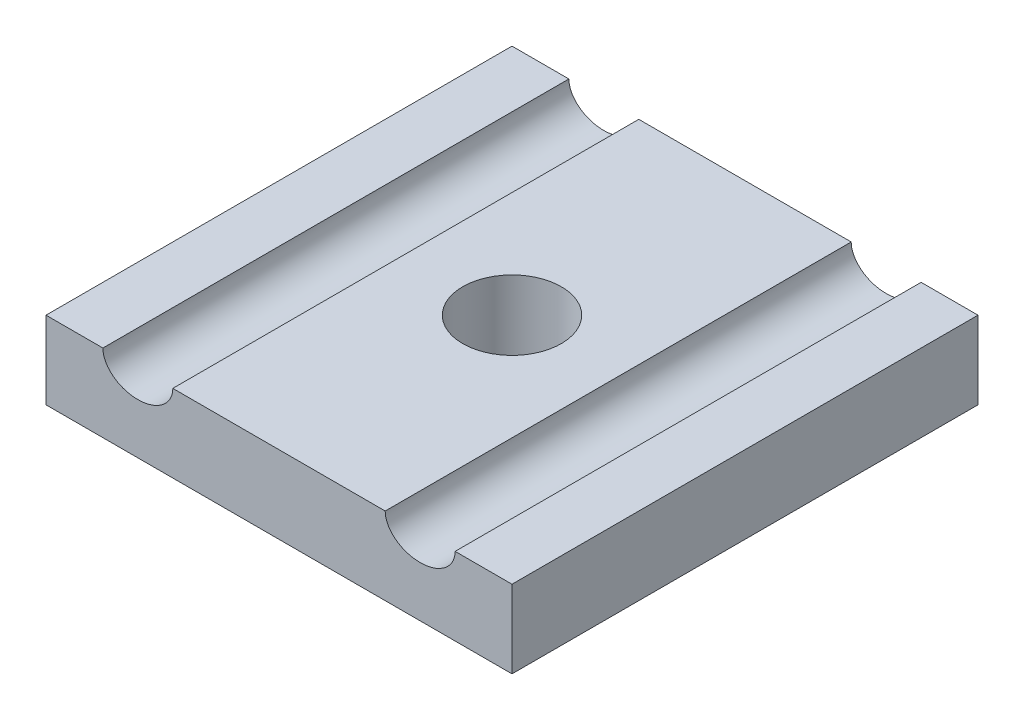
ISO-10303-21;
HEADER;
FILE_DESCRIPTION(('STEP AP214'),'2;1');
FILE_NAME('part.step','',(''),(''),'','','');
FILE_SCHEMA(('AUTOMOTIVE_DESIGN { 1 0 10303 214 1 1 1 1 }'));
ENDSEC;
DATA;
#1=APPLICATION_CONTEXT('core data for automotive mechanical design processes');
#2=APPLICATION_PROTOCOL_DEFINITION('international standard','automotive_design',2000,#1);
#3=PRODUCT_CONTEXT('',#1,'mechanical');
#4=PRODUCT('Part','Part','',(#3));
#5=PRODUCT_RELATED_PRODUCT_CATEGORY('part','',(#4));
#6=PRODUCT_DEFINITION_FORMATION('','',#4);
#7=PRODUCT_DEFINITION_CONTEXT('part definition',#1,'design');
#8=PRODUCT_DEFINITION('design','',#6,#7);
#9=PRODUCT_DEFINITION_SHAPE('','',#8);
#10=(LENGTH_UNIT() NAMED_UNIT(*) SI_UNIT(.MILLI.,.METRE.));
#11=(NAMED_UNIT(*) PLANE_ANGLE_UNIT() SI_UNIT($,.RADIAN.));
#12=(NAMED_UNIT(*) SI_UNIT($,.STERADIAN.) SOLID_ANGLE_UNIT());
#13=UNCERTAINTY_MEASURE_WITH_UNIT(LENGTH_MEASURE(1.E-05),#10,'distance_accuracy_value','');
#14=(GEOMETRIC_REPRESENTATION_CONTEXT(3) GLOBAL_UNCERTAINTY_ASSIGNED_CONTEXT((#13)) GLOBAL_UNIT_ASSIGNED_CONTEXT((#10,
#11,#12)) REPRESENTATION_CONTEXT('',''));
#15=CARTESIAN_POINT('',(0.,0.,0.));
#16=DIRECTION('',(0.,0.,1.));
#17=DIRECTION('',(1.,0.,0.));
#18=AXIS2_PLACEMENT_3D('',#15,#16,#17);
#19=CARTESIAN_POINT('',(0.,5.,0.));
#20=DIRECTION('',(0.,-1.,0.));
#21=DIRECTION('',(0.,0.,-1.));
#22=AXIS2_PLACEMENT_3D('',#19,#20,#21);
#23=PLANE('',#22);
#24=DIRECTION('',(-1.,0.,0.));
#25=VECTOR('',#24,1.);
#26=CARTESIAN_POINT('',(0.,5.,0.));
#27=LINE('',#26,#25);
#28=CARTESIAN_POINT('',(0.,5.,0.));
#29=VERTEX_POINT('',#28);
#30=CARTESIAN_POINT('',(-3.6625,5.,0.));
#31=VERTEX_POINT('',#30);
#32=EDGE_CURVE('E116',#29,#31,#27,.T.);
#33=ORIENTED_EDGE('',*,*,#32,.T.);
#34=DIRECTION('',(0.,0.,1.));
#35=VECTOR('',#34,1.);
#36=CARTESIAN_POINT('',(-3.6625,5.,15.));
#37=LINE('',#36,#35);
#38=CARTESIAN_POINT('',(-3.6625,5.,30.));
#39=VERTEX_POINT('',#38);
#40=EDGE_CURVE('E101',#31,#39,#37,.T.);
#41=ORIENTED_EDGE('',*,*,#40,.T.);
#42=DIRECTION('',(1.,0.,0.));
#43=VECTOR('',#42,1.);
#44=CARTESIAN_POINT('',(0.,5.,30.));
#45=LINE('',#44,#43);
#46=CARTESIAN_POINT('',(0.,5.,30.));
#47=VERTEX_POINT('',#46);
#48=EDGE_CURVE('E125',#39,#47,#45,.T.);
#49=ORIENTED_EDGE('',*,*,#48,.T.);
#50=DIRECTION('',(0.,0.,-1.));
#51=VECTOR('',#50,1.);
#52=CARTESIAN_POINT('',(0.,5.,0.));
#53=LINE('',#52,#51);
#54=EDGE_CURVE('E120',#47,#29,#53,.T.);
#55=ORIENTED_EDGE('',*,*,#54,.T.);
#56=EDGE_LOOP('',(#33,#41,#49,#55));
#57=FACE_BOUND('',#56,.T.);
#58=ADVANCED_FACE('F34',(#57),#23,.F.);
#59=CARTESIAN_POINT('',(-15.,5.,15.));
#60=DIRECTION('',(0.,1.,0.));
#61=DIRECTION('',(0.,0.,1.));
#62=AXIS2_PLACEMENT_3D('',#59,#60,#61);
#63=CIRCLE('',#62,3.175);
#64=CARTESIAN_POINT('',(-15.,5.,18.175));
#65=VERTEX_POINT('',#64);
#66=EDGE_CURVE('E166',#65,#65,#63,.T.);
#67=ORIENTED_EDGE('',*,*,#66,.F.);
#68=EDGE_LOOP('',(#67));
#69=FACE_BOUND('',#68,.T.);
#70=CARTESIAN_POINT('',(-21.8375,5.,30.));
#71=VERTEX_POINT('',#70);
#72=CARTESIAN_POINT('',(-8.1625,5.,30.));
#73=VERTEX_POINT('',#72);
#74=EDGE_CURVE('E112',#71,#73,#45,.T.);
#75=ORIENTED_EDGE('',*,*,#74,.T.);
#76=DIRECTION('',(0.,0.,1.));
#77=VECTOR('',#76,1.);
#78=CARTESIAN_POINT('',(-8.1625,5.,15.));
#79=LINE('',#78,#77);
#80=CARTESIAN_POINT('',(-8.1625,5.,0.));
#81=VERTEX_POINT('',#80);
#82=EDGE_CURVE('E49',#73,#81,#79,.F.);
#83=ORIENTED_EDGE('',*,*,#82,.T.);
#84=CARTESIAN_POINT('',(-21.8375,5.,0.));
#85=VERTEX_POINT('',#84);
#86=EDGE_CURVE('E110',#81,#85,#27,.T.);
#87=ORIENTED_EDGE('',*,*,#86,.T.);
#88=DIRECTION('',(0.,0.,1.));
#89=VECTOR('',#88,1.);
#90=CARTESIAN_POINT('',(-21.8375,5.,15.));
#91=LINE('',#90,#89);
#92=EDGE_CURVE('E11',#85,#71,#91,.T.);
#93=ORIENTED_EDGE('',*,*,#92,.T.);
#94=EDGE_LOOP('',(#75,#83,#87,#93));
#95=FACE_BOUND('',#94,.T.);
#96=ADVANCED_FACE('F109',(#69,#95),#23,.F.);
#97=CARTESIAN_POINT('',(0.,5.,0.));
#98=DIRECTION('',(-1.,0.,0.));
#99=DIRECTION('',(0.,0.,1.));
#100=AXIS2_PLACEMENT_3D('',#97,#98,#99);
#101=PLANE('',#100);
#102=DIRECTION('',(0.,0.,-1.));
#103=VECTOR('',#102,1.);
#104=CARTESIAN_POINT('',(0.,0.,0.));
#105=LINE('',#104,#103);
#106=CARTESIAN_POINT('',(0.,0.,30.));
#107=VERTEX_POINT('',#106);
#108=CARTESIAN_POINT('',(0.,0.,0.));
#109=VERTEX_POINT('',#108);
#110=EDGE_CURVE('E130',#107,#109,#105,.T.);
#111=ORIENTED_EDGE('',*,*,#110,.T.);
#112=DIRECTION('',(0.,-1.,0.));
#113=VECTOR('',#112,1.);
#114=CARTESIAN_POINT('',(0.,5.,0.));
#115=LINE('',#114,#113);
#116=EDGE_CURVE('E148',#29,#109,#115,.T.);
#117=ORIENTED_EDGE('',*,*,#116,.F.);
#118=ORIENTED_EDGE('',*,*,#54,.F.);
#119=DIRECTION('',(0.,-1.,0.));
#120=VECTOR('',#119,1.);
#121=CARTESIAN_POINT('',(0.,5.,30.));
#122=LINE('',#121,#120);
#123=EDGE_CURVE('E129',#47,#107,#122,.T.);
#124=ORIENTED_EDGE('',*,*,#123,.T.);
#125=EDGE_LOOP('',(#111,#117,#118,#124));
#126=FACE_BOUND('',#125,.T.);
#127=ADVANCED_FACE('F36',(#126),#101,.F.);
#128=CARTESIAN_POINT('',(0.,5.,0.));
#129=DIRECTION('',(0.,0.,1.));
#130=DIRECTION('',(1.,0.,0.));
#131=AXIS2_PLACEMENT_3D('',#128,#129,#130);
#132=PLANE('',#131);
#133=ORIENTED_EDGE('',*,*,#86,.F.);
#134=CARTESIAN_POINT('',(-5.9125,5.,0.));
#135=DIRECTION('',(0.,0.,1.));
#136=DIRECTION('',(-1.,0.,0.));
#137=AXIS2_PLACEMENT_3D('',#134,#135,#136);
#138=ELLIPSE('',#137,2.25,1.75);
#139=EDGE_CURVE('E98',#31,#81,#138,.F.);
#140=ORIENTED_EDGE('',*,*,#139,.F.);
#141=ORIENTED_EDGE('',*,*,#32,.F.);
#142=ORIENTED_EDGE('',*,*,#116,.T.);
#143=DIRECTION('',(-1.,0.,0.));
#144=VECTOR('',#143,1.);
#145=CARTESIAN_POINT('',(0.,0.,0.));
#146=LINE('',#145,#144);
#147=CARTESIAN_POINT('',(-30.,0.,0.));
#148=VERTEX_POINT('',#147);
#149=EDGE_CURVE('E133',#109,#148,#146,.T.);
#150=ORIENTED_EDGE('',*,*,#149,.T.);
#151=DIRECTION('',(0.,-1.,0.));
#152=VECTOR('',#151,1.);
#153=CARTESIAN_POINT('',(-30.,5.,0.));
#154=LINE('',#153,#152);
#155=CARTESIAN_POINT('',(-30.,5.,0.));
#156=VERTEX_POINT('',#155);
#157=EDGE_CURVE('E145',#156,#148,#154,.T.);
#158=ORIENTED_EDGE('',*,*,#157,.F.);
#159=CARTESIAN_POINT('',(-26.3375,5.,0.));
#160=VERTEX_POINT('',#159);
#161=EDGE_CURVE('E117',#160,#156,#27,.T.);
#162=ORIENTED_EDGE('',*,*,#161,.F.);
#163=CARTESIAN_POINT('',(-24.0875,5.,0.));
#164=DIRECTION('',(0.,0.,1.));
#165=DIRECTION('',(-1.,0.,0.));
#166=AXIS2_PLACEMENT_3D('',#163,#164,#165);
#167=ELLIPSE('',#166,2.25,1.75);
#168=EDGE_CURVE('E57',#85,#160,#167,.F.);
#169=ORIENTED_EDGE('',*,*,#168,.F.);
#170=EDGE_LOOP('',(#133,#140,#141,#142,#150,#158,#162,#169));
#171=FACE_BOUND('',#170,.T.);
#172=ADVANCED_FACE('F114',(#171),#132,.F.);
#173=CARTESIAN_POINT('',(-30.,5.,0.));
#174=DIRECTION('',(1.,0.,0.));
#175=DIRECTION('',(0.,0.,-1.));
#176=AXIS2_PLACEMENT_3D('',#173,#174,#175);
#177=PLANE('',#176);
#178=DIRECTION('',(0.,0.,1.));
#179=VECTOR('',#178,1.);
#180=CARTESIAN_POINT('',(-30.,0.,0.));
#181=LINE('',#180,#179);
#182=CARTESIAN_POINT('',(-30.,0.,30.));
#183=VERTEX_POINT('',#182);
#184=EDGE_CURVE('E136',#148,#183,#181,.T.);
#185=ORIENTED_EDGE('',*,*,#184,.T.);
#186=DIRECTION('',(0.,-1.,0.));
#187=VECTOR('',#186,1.);
#188=CARTESIAN_POINT('',(-30.,5.,30.));
#189=LINE('',#188,#187);
#190=CARTESIAN_POINT('',(-30.,5.,30.));
#191=VERTEX_POINT('',#190);
#192=EDGE_CURVE('E142',#191,#183,#189,.T.);
#193=ORIENTED_EDGE('',*,*,#192,.F.);
#194=DIRECTION('',(0.,0.,1.));
#195=VECTOR('',#194,1.);
#196=CARTESIAN_POINT('',(-30.,5.,0.));
#197=LINE('',#196,#195);
#198=EDGE_CURVE('E119',#156,#191,#197,.T.);
#199=ORIENTED_EDGE('',*,*,#198,.F.);
#200=ORIENTED_EDGE('',*,*,#157,.T.);
#201=EDGE_LOOP('',(#185,#193,#199,#200));
#202=FACE_BOUND('',#201,.T.);
#203=ADVANCED_FACE('F159',(#202),#177,.F.);
#204=CARTESIAN_POINT('',(0.,5.,30.));
#205=DIRECTION('',(0.,0.,-1.));
#206=DIRECTION('',(-1.,0.,0.));
#207=AXIS2_PLACEMENT_3D('',#204,#205,#206);
#208=PLANE('',#207);
#209=ORIENTED_EDGE('',*,*,#48,.F.);
#210=CARTESIAN_POINT('',(-5.9125,5.,30.));
#211=DIRECTION('',(0.,0.,1.));
#212=DIRECTION('',(-1.,0.,0.));
#213=AXIS2_PLACEMENT_3D('',#210,#211,#212);
#214=ELLIPSE('',#213,2.25,1.75);
#215=EDGE_CURVE('E105',#73,#39,#214,.T.);
#216=ORIENTED_EDGE('',*,*,#215,.F.);
#217=ORIENTED_EDGE('',*,*,#74,.F.);
#218=CARTESIAN_POINT('',(-24.0875,5.,30.));
#219=DIRECTION('',(0.,0.,1.));
#220=DIRECTION('',(-1.,0.,0.));
#221=AXIS2_PLACEMENT_3D('',#218,#219,#220);
#222=ELLIPSE('',#221,2.25,1.75);
#223=CARTESIAN_POINT('',(-26.3375,5.,30.));
#224=VERTEX_POINT('',#223);
#225=EDGE_CURVE('E164',#224,#71,#222,.T.);
#226=ORIENTED_EDGE('',*,*,#225,.F.);
#227=EDGE_CURVE('E126',#191,#224,#45,.T.);
#228=ORIENTED_EDGE('',*,*,#227,.F.);
#229=ORIENTED_EDGE('',*,*,#192,.T.);
#230=DIRECTION('',(1.,0.,0.));
#231=VECTOR('',#230,1.);
#232=CARTESIAN_POINT('',(0.,0.,30.));
#233=LINE('',#232,#231);
#234=EDGE_CURVE('E138',#183,#107,#233,.T.);
#235=ORIENTED_EDGE('',*,*,#234,.T.);
#236=ORIENTED_EDGE('',*,*,#123,.F.);
#237=EDGE_LOOP('',(#209,#216,#217,#226,#228,#229,#235,#236));
#238=FACE_BOUND('',#237,.T.);
#239=ADVANCED_FACE('F163',(#238),#208,.F.);
#240=ORIENTED_EDGE('',*,*,#227,.T.);
#241=DIRECTION('',(0.,0.,1.));
#242=VECTOR('',#241,1.);
#243=CARTESIAN_POINT('',(-26.3375,5.,15.));
#244=LINE('',#243,#242);
#245=EDGE_CURVE('E42',#224,#160,#244,.F.);
#246=ORIENTED_EDGE('',*,*,#245,.T.);
#247=ORIENTED_EDGE('',*,*,#161,.T.);
#248=ORIENTED_EDGE('',*,*,#198,.T.);
#249=EDGE_LOOP('',(#240,#246,#247,#248));
#250=FACE_BOUND('',#249,.T.);
#251=ADVANCED_FACE('F151',(#250),#23,.F.);
#252=CARTESIAN_POINT('',(0.,0.,0.));
#253=DIRECTION('',(0.,-1.,0.));
#254=DIRECTION('',(0.,0.,-1.));
#255=AXIS2_PLACEMENT_3D('',#252,#253,#254);
#256=PLANE('',#255);
#257=CARTESIAN_POINT('',(-15.,0.,15.));
#258=DIRECTION('',(0.,1.,0.));
#259=DIRECTION('',(0.,0.,1.));
#260=AXIS2_PLACEMENT_3D('',#257,#258,#259);
#261=CIRCLE('',#260,3.175);
#262=CARTESIAN_POINT('',(-15.,0.,18.175));
#263=VERTEX_POINT('',#262);
#264=EDGE_CURVE('E134',#263,#263,#261,.T.);
#265=ORIENTED_EDGE('',*,*,#264,.T.);
#266=EDGE_LOOP('',(#265));
#267=FACE_BOUND('',#266,.T.);
#268=ORIENTED_EDGE('',*,*,#110,.F.);
#269=ORIENTED_EDGE('',*,*,#234,.F.);
#270=ORIENTED_EDGE('',*,*,#184,.F.);
#271=ORIENTED_EDGE('',*,*,#149,.F.);
#272=EDGE_LOOP('',(#268,#269,#270,#271));
#273=FACE_BOUND('',#272,.T.);
#274=ADVANCED_FACE('F189',(#267,#273),#256,.T.);
#275=CARTESIAN_POINT('',(-15.,0.,15.));
#276=DIRECTION('',(0.,1.,0.));
#277=DIRECTION('',(0.,0.,1.));
#278=AXIS2_PLACEMENT_3D('',#275,#276,#277);
#279=CYLINDRICAL_SURFACE('',#278,3.175);
#280=ORIENTED_EDGE('',*,*,#264,.F.);
#281=EDGE_LOOP('',(#280));
#282=FACE_BOUND('',#281,.T.);
#283=ORIENTED_EDGE('',*,*,#66,.T.);
#284=EDGE_LOOP('',(#283));
#285=FACE_BOUND('',#284,.T.);
#286=ADVANCED_FACE('F176',(#282,#285),#279,.F.);
#287=CARTESIAN_POINT('',(-24.0875,5.,-5.70087712549569));
#288=DIRECTION('',(0.,0.,1.));
#289=DIRECTION('',(-1.,0.,0.));
#290=AXIS2_PLACEMENT_3D('',#287,#288,#289);
#291=ELLIPSE('',#290,2.25,1.75);
#292=DIRECTION('',(0.,0.,1.));
#293=VECTOR('',#292,1.);
#294=SURFACE_OF_LINEAR_EXTRUSION('',#291,#293);
#295=ORIENTED_EDGE('',*,*,#168,.T.);
#296=ORIENTED_EDGE('',*,*,#245,.F.);
#297=ORIENTED_EDGE('',*,*,#225,.T.);
#298=ORIENTED_EDGE('',*,*,#92,.F.);
#299=EDGE_LOOP('',(#295,#296,#297,#298));
#300=FACE_BOUND('',#299,.T.);
#301=ADVANCED_FACE('F228',(#300),#294,.F.);
#302=CARTESIAN_POINT('',(-5.9125,5.,-5.70087712549569));
#303=DIRECTION('',(0.,0.,1.));
#304=DIRECTION('',(-1.,0.,0.));
#305=AXIS2_PLACEMENT_3D('',#302,#303,#304);
#306=ELLIPSE('',#305,2.25,1.75);
#307=DIRECTION('',(0.,0.,1.));
#308=VECTOR('',#307,1.);
#309=SURFACE_OF_LINEAR_EXTRUSION('',#306,#308);
#310=ORIENTED_EDGE('',*,*,#139,.T.);
#311=ORIENTED_EDGE('',*,*,#82,.F.);
#312=ORIENTED_EDGE('',*,*,#215,.T.);
#313=ORIENTED_EDGE('',*,*,#40,.F.);
#314=EDGE_LOOP('',(#310,#311,#312,#313));
#315=FACE_BOUND('',#314,.T.);
#316=ADVANCED_FACE('F99',(#315),#309,.F.);
#317=CLOSED_SHELL('',(#58,#96,#127,#172,#203,#239,#251,#274,#286,#301,#316));
#318=MANIFOLD_SOLID_BREP('B2',#317);
#319=ADVANCED_BREP_SHAPE_REPRESENTATION('',(#18,#318),#14);
#320=SHAPE_DEFINITION_REPRESENTATION(#9,#319);
ENDSEC;
END-ISO-10303-21;
